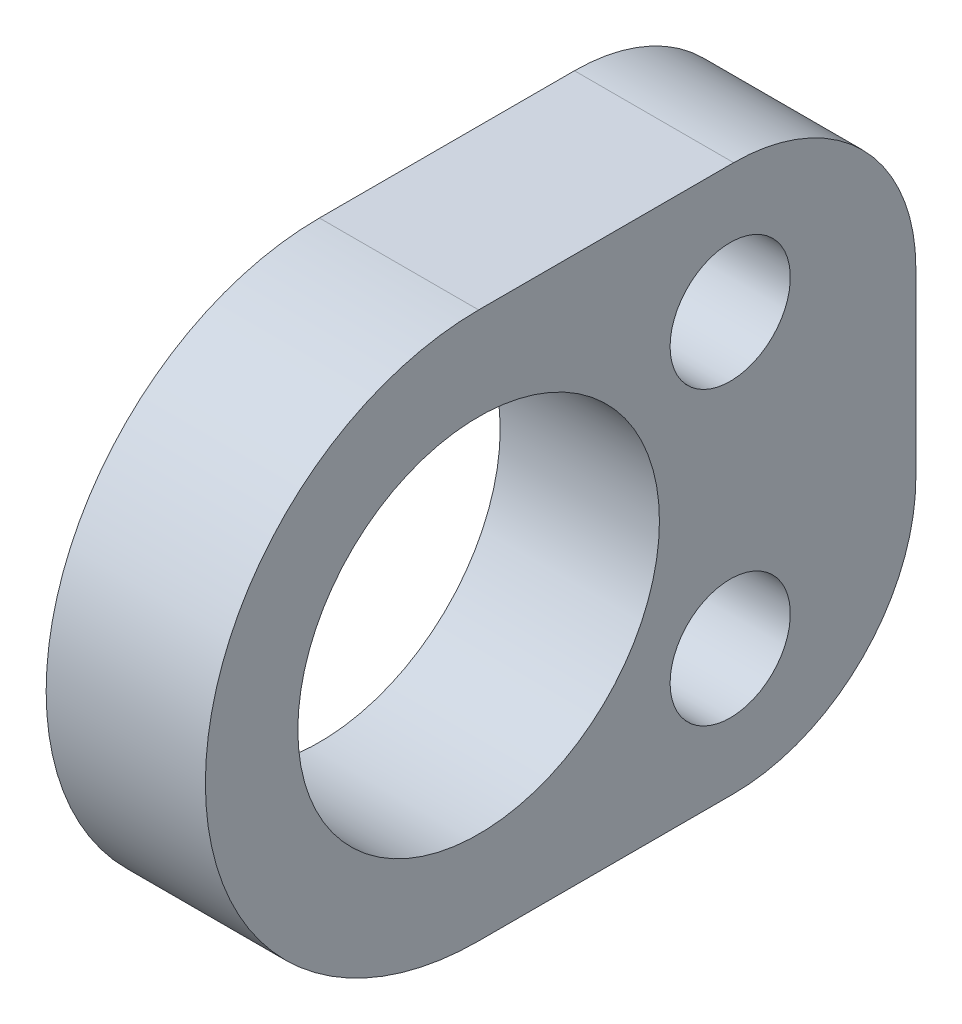
ISO-10303-21;
HEADER;
FILE_DESCRIPTION(('STEP AP214'),'2;1');
FILE_NAME('part.step','',(''),(''),'','','');
FILE_SCHEMA(('AUTOMOTIVE_DESIGN { 1 0 10303 214 1 1 1 1 }'));
ENDSEC;
DATA;
#1=APPLICATION_CONTEXT('core data for automotive mechanical design processes');
#2=APPLICATION_PROTOCOL_DEFINITION('international standard','automotive_design',2000,#1);
#3=PRODUCT_CONTEXT('',#1,'mechanical');
#4=PRODUCT('Part','Part','',(#3));
#5=PRODUCT_RELATED_PRODUCT_CATEGORY('part','',(#4));
#6=PRODUCT_DEFINITION_FORMATION('','',#4);
#7=PRODUCT_DEFINITION_CONTEXT('part definition',#1,'design');
#8=PRODUCT_DEFINITION('design','',#6,#7);
#9=PRODUCT_DEFINITION_SHAPE('','',#8);
#10=(LENGTH_UNIT() NAMED_UNIT(*) SI_UNIT(.MILLI.,.METRE.));
#11=(NAMED_UNIT(*) PLANE_ANGLE_UNIT() SI_UNIT($,.RADIAN.));
#12=(NAMED_UNIT(*) SI_UNIT($,.STERADIAN.) SOLID_ANGLE_UNIT());
#13=UNCERTAINTY_MEASURE_WITH_UNIT(LENGTH_MEASURE(1.E-05),#10,'distance_accuracy_value','');
#14=(GEOMETRIC_REPRESENTATION_CONTEXT(3) GLOBAL_UNCERTAINTY_ASSIGNED_CONTEXT((#13)) GLOBAL_UNIT_ASSIGNED_CONTEXT((#10,
#11,#12)) REPRESENTATION_CONTEXT('',''));
#15=CARTESIAN_POINT('',(0.,0.,0.));
#16=DIRECTION('',(0.,0.,1.));
#17=DIRECTION('',(1.,0.,0.));
#18=AXIS2_PLACEMENT_3D('',#15,#16,#17);
#19=CARTESIAN_POINT('',(4.37,0.,0.));
#20=DIRECTION('',(1.,0.,0.));
#21=DIRECTION('',(0.,0.,-1.));
#22=AXIS2_PLACEMENT_3D('',#19,#20,#21);
#23=PLANE('',#22);
#24=CARTESIAN_POINT('',(4.37,-4.,-6.9050995648144));
#25=DIRECTION('',(-1.,0.,0.));
#26=DIRECTION('',(0.,0.,1.));
#27=AXIS2_PLACEMENT_3D('',#24,#25,#26);
#28=CIRCLE('',#27,1.65);
#29=CARTESIAN_POINT('',(4.37,-4.,-5.2550995648144));
#30=VERTEX_POINT('',#29);
#31=EDGE_CURVE('E194',#30,#30,#28,.T.);
#32=ORIENTED_EDGE('',*,*,#31,.T.);
#33=EDGE_LOOP('',(#32));
#34=FACE_BOUND('',#33,.T.);
#35=CARTESIAN_POINT('',(4.37,4.,-6.9050995648144));
#36=DIRECTION('',(-1.,0.,0.));
#37=DIRECTION('',(0.,0.,1.));
#38=AXIS2_PLACEMENT_3D('',#35,#36,#37);
#39=CIRCLE('',#38,1.65);
#40=CARTESIAN_POINT('',(4.37,4.,-5.2550995648144));
#41=VERTEX_POINT('',#40);
#42=EDGE_CURVE('E202',#41,#41,#39,.T.);
#43=ORIENTED_EDGE('',*,*,#42,.T.);
#44=EDGE_LOOP('',(#43));
#45=FACE_BOUND('',#44,.T.);
#46=DIRECTION('',(0.,0.,1.));
#47=VECTOR('',#46,1.);
#48=CARTESIAN_POINT('',(4.37,-7.5,-12.));
#49=LINE('',#48,#47);
#50=CARTESIAN_POINT('',(4.37,-7.5,-7.));
#51=VERTEX_POINT('',#50);
#52=CARTESIAN_POINT('',(4.37,-7.5,0.));
#53=VERTEX_POINT('',#52);
#54=EDGE_CURVE('E117',#51,#53,#49,.T.);
#55=ORIENTED_EDGE('',*,*,#54,.F.);
#56=CARTESIAN_POINT('',(4.37,-2.5,-7.));
#57=DIRECTION('',(1.,0.,0.));
#58=DIRECTION('',(0.,0.,-1.));
#59=AXIS2_PLACEMENT_3D('',#56,#57,#58);
#60=CIRCLE('',#59,5.);
#61=CARTESIAN_POINT('',(4.37,-2.5,-12.));
#62=VERTEX_POINT('',#61);
#63=EDGE_CURVE('E71',#51,#62,#60,.T.);
#64=ORIENTED_EDGE('',*,*,#63,.T.);
#65=DIRECTION('',(0.,-1.,0.));
#66=VECTOR('',#65,1.);
#67=CARTESIAN_POINT('',(4.37,7.5,-12.));
#68=LINE('',#67,#66);
#69=CARTESIAN_POINT('',(4.37,2.5,-12.));
#70=VERTEX_POINT('',#69);
#71=EDGE_CURVE('E126',#70,#62,#68,.T.);
#72=ORIENTED_EDGE('',*,*,#71,.F.);
#73=CARTESIAN_POINT('',(4.37,2.5,-7.));
#74=DIRECTION('',(1.,0.,0.));
#75=DIRECTION('',(0.,0.,-1.));
#76=AXIS2_PLACEMENT_3D('',#73,#74,#75);
#77=CIRCLE('',#76,5.);
#78=CARTESIAN_POINT('',(4.37,7.5,-7.));
#79=VERTEX_POINT('',#78);
#80=EDGE_CURVE('E78',#70,#79,#77,.T.);
#81=ORIENTED_EDGE('',*,*,#80,.T.);
#82=DIRECTION('',(0.,0.,-1.));
#83=VECTOR('',#82,1.);
#84=CARTESIAN_POINT('',(4.37,7.5,0.));
#85=LINE('',#84,#83);
#86=CARTESIAN_POINT('',(4.37,7.5,0.));
#87=VERTEX_POINT('',#86);
#88=EDGE_CURVE('E130',#87,#79,#85,.T.);
#89=ORIENTED_EDGE('',*,*,#88,.F.);
#90=CARTESIAN_POINT('',(4.37,0.,0.));
#91=DIRECTION('',(1.,0.,0.));
#92=DIRECTION('',(0.,0.,-1.));
#93=AXIS2_PLACEMENT_3D('',#90,#91,#92);
#94=CIRCLE('',#93,7.5);
#95=EDGE_CURVE('E125',#87,#53,#94,.T.);
#96=ORIENTED_EDGE('',*,*,#95,.T.);
#97=EDGE_LOOP('',(#55,#64,#72,#81,#89,#96));
#98=FACE_BOUND('',#97,.T.);
#99=CARTESIAN_POINT('',(4.37,0.,0.));
#100=DIRECTION('',(1.,0.,0.));
#101=DIRECTION('',(0.,0.,-1.));
#102=AXIS2_PLACEMENT_3D('',#99,#100,#101);
#103=CIRCLE('',#102,4.9625);
#104=CARTESIAN_POINT('',(4.37,0.,-4.9625));
#105=VERTEX_POINT('',#104);
#106=EDGE_CURVE('E186',#105,#105,#103,.T.);
#107=ORIENTED_EDGE('',*,*,#106,.F.);
#108=EDGE_LOOP('',(#107));
#109=FACE_BOUND('',#108,.T.);
#110=ADVANCED_FACE('F62',(#34,#45,#98,#109),#23,.T.);
#111=CARTESIAN_POINT('',(0.,0.,0.));
#112=DIRECTION('',(1.,0.,0.));
#113=DIRECTION('',(0.,0.,-1.));
#114=AXIS2_PLACEMENT_3D('',#111,#112,#113);
#115=PLANE('',#114);
#116=CARTESIAN_POINT('',(0.,-4.,-6.9050995648144));
#117=DIRECTION('',(-1.,0.,0.));
#118=DIRECTION('',(0.,0.,1.));
#119=AXIS2_PLACEMENT_3D('',#116,#117,#118);
#120=CIRCLE('',#119,1.65);
#121=CARTESIAN_POINT('',(0.,-4.,-5.2550995648144));
#122=VERTEX_POINT('',#121);
#123=EDGE_CURVE('E206',#122,#122,#120,.T.);
#124=ORIENTED_EDGE('',*,*,#123,.F.);
#125=EDGE_LOOP('',(#124));
#126=FACE_BOUND('',#125,.T.);
#127=CARTESIAN_POINT('',(0.,4.,-6.9050995648144));
#128=DIRECTION('',(-1.,0.,0.));
#129=DIRECTION('',(0.,0.,1.));
#130=AXIS2_PLACEMENT_3D('',#127,#128,#129);
#131=CIRCLE('',#130,1.65);
#132=CARTESIAN_POINT('',(0.,4.,-5.2550995648144));
#133=VERTEX_POINT('',#132);
#134=EDGE_CURVE('E198',#133,#133,#131,.T.);
#135=ORIENTED_EDGE('',*,*,#134,.F.);
#136=EDGE_LOOP('',(#135));
#137=FACE_BOUND('',#136,.T.);
#138=DIRECTION('',(0.,-1.,0.));
#139=VECTOR('',#138,1.);
#140=CARTESIAN_POINT('',(0.,7.5,-12.));
#141=LINE('',#140,#139);
#142=CARTESIAN_POINT('',(0.,2.5,-12.));
#143=VERTEX_POINT('',#142);
#144=CARTESIAN_POINT('',(0.,-2.5,-12.));
#145=VERTEX_POINT('',#144);
#146=EDGE_CURVE('E176',#143,#145,#141,.T.);
#147=ORIENTED_EDGE('',*,*,#146,.T.);
#148=CARTESIAN_POINT('',(0.,-2.5,-7.));
#149=DIRECTION('',(1.,0.,0.));
#150=DIRECTION('',(0.,0.,-1.));
#151=AXIS2_PLACEMENT_3D('',#148,#149,#150);
#152=CIRCLE('',#151,5.);
#153=CARTESIAN_POINT('',(0.,-7.5,-7.));
#154=VERTEX_POINT('',#153);
#155=EDGE_CURVE('E154',#145,#154,#152,.F.);
#156=ORIENTED_EDGE('',*,*,#155,.T.);
#157=DIRECTION('',(0.,0.,1.));
#158=VECTOR('',#157,1.);
#159=CARTESIAN_POINT('',(0.,-7.5,-12.));
#160=LINE('',#159,#158);
#161=CARTESIAN_POINT('',(0.,-7.5,0.));
#162=VERTEX_POINT('',#161);
#163=EDGE_CURVE('E175',#154,#162,#160,.T.);
#164=ORIENTED_EDGE('',*,*,#163,.T.);
#165=CARTESIAN_POINT('',(0.,0.,0.));
#166=DIRECTION('',(1.,0.,0.));
#167=DIRECTION('',(0.,0.,-1.));
#168=AXIS2_PLACEMENT_3D('',#165,#166,#167);
#169=CIRCLE('',#168,7.5);
#170=CARTESIAN_POINT('',(0.,7.5,0.));
#171=VERTEX_POINT('',#170);
#172=EDGE_CURVE('E136',#171,#162,#169,.T.);
#173=ORIENTED_EDGE('',*,*,#172,.F.);
#174=DIRECTION('',(0.,0.,-1.));
#175=VECTOR('',#174,1.);
#176=CARTESIAN_POINT('',(0.,7.5,0.));
#177=LINE('',#176,#175);
#178=CARTESIAN_POINT('',(0.,7.5,-7.));
#179=VERTEX_POINT('',#178);
#180=EDGE_CURVE('E181',#171,#179,#177,.T.);
#181=ORIENTED_EDGE('',*,*,#180,.T.);
#182=CARTESIAN_POINT('',(0.,2.5,-7.));
#183=DIRECTION('',(1.,0.,0.));
#184=DIRECTION('',(0.,0.,-1.));
#185=AXIS2_PLACEMENT_3D('',#182,#183,#184);
#186=CIRCLE('',#185,5.);
#187=EDGE_CURVE('E151',#179,#143,#186,.F.);
#188=ORIENTED_EDGE('',*,*,#187,.T.);
#189=EDGE_LOOP('',(#147,#156,#164,#173,#181,#188));
#190=FACE_BOUND('',#189,.T.);
#191=CARTESIAN_POINT('',(0.,0.,0.));
#192=DIRECTION('',(1.,0.,0.));
#193=DIRECTION('',(0.,0.,-1.));
#194=AXIS2_PLACEMENT_3D('',#191,#192,#193);
#195=CIRCLE('',#194,4.9625);
#196=CARTESIAN_POINT('',(0.,0.,-4.9625));
#197=VERTEX_POINT('',#196);
#198=EDGE_CURVE('E190',#197,#197,#195,.T.);
#199=ORIENTED_EDGE('',*,*,#198,.T.);
#200=EDGE_LOOP('',(#199));
#201=FACE_BOUND('',#200,.T.);
#202=ADVANCED_FACE('F173',(#126,#137,#190,#201),#115,.F.);
#203=CARTESIAN_POINT('',(4.37,7.5,0.));
#204=DIRECTION('',(0.,1.,0.));
#205=DIRECTION('',(0.,0.,1.));
#206=AXIS2_PLACEMENT_3D('',#203,#204,#205);
#207=PLANE('',#206);
#208=ORIENTED_EDGE('',*,*,#88,.T.);
#209=DIRECTION('',(-1.,0.,0.));
#210=VECTOR('',#209,1.);
#211=CARTESIAN_POINT('',(4.37,7.5,-7.));
#212=LINE('',#211,#210);
#213=EDGE_CURVE('E12',#79,#179,#212,.T.);
#214=ORIENTED_EDGE('',*,*,#213,.T.);
#215=ORIENTED_EDGE('',*,*,#180,.F.);
#216=DIRECTION('',(-1.,0.,0.));
#217=VECTOR('',#216,1.);
#218=CARTESIAN_POINT('',(4.37,7.5,0.));
#219=LINE('',#218,#217);
#220=EDGE_CURVE('E138',#87,#171,#219,.T.);
#221=ORIENTED_EDGE('',*,*,#220,.F.);
#222=EDGE_LOOP('',(#208,#214,#215,#221));
#223=FACE_BOUND('',#222,.T.);
#224=ADVANCED_FACE('F225',(#223),#207,.T.);
#225=CARTESIAN_POINT('',(4.37,0.,0.));
#226=DIRECTION('',(-1.,0.,0.));
#227=DIRECTION('',(0.,0.,1.));
#228=AXIS2_PLACEMENT_3D('',#225,#226,#227);
#229=CYLINDRICAL_SURFACE('',#228,7.5);
#230=ORIENTED_EDGE('',*,*,#172,.T.);
#231=DIRECTION('',(-1.,0.,0.));
#232=VECTOR('',#231,1.);
#233=CARTESIAN_POINT('',(4.37,-7.5,0.));
#234=LINE('',#233,#232);
#235=EDGE_CURVE('E121',#53,#162,#234,.T.);
#236=ORIENTED_EDGE('',*,*,#235,.F.);
#237=ORIENTED_EDGE('',*,*,#95,.F.);
#238=ORIENTED_EDGE('',*,*,#220,.T.);
#239=EDGE_LOOP('',(#230,#236,#237,#238));
#240=FACE_BOUND('',#239,.T.);
#241=ADVANCED_FACE('F134',(#240),#229,.T.);
#242=CARTESIAN_POINT('',(4.37,-7.5,-12.));
#243=DIRECTION('',(0.,-1.,0.));
#244=DIRECTION('',(0.,0.,-1.));
#245=AXIS2_PLACEMENT_3D('',#242,#243,#244);
#246=PLANE('',#245);
#247=ORIENTED_EDGE('',*,*,#163,.F.);
#248=DIRECTION('',(-1.,0.,0.));
#249=VECTOR('',#248,1.);
#250=CARTESIAN_POINT('',(4.37,-7.5,-7.));
#251=LINE('',#250,#249);
#252=EDGE_CURVE('E86',#154,#51,#251,.F.);
#253=ORIENTED_EDGE('',*,*,#252,.T.);
#254=ORIENTED_EDGE('',*,*,#54,.T.);
#255=ORIENTED_EDGE('',*,*,#235,.T.);
#256=EDGE_LOOP('',(#247,#253,#254,#255));
#257=FACE_BOUND('',#256,.T.);
#258=ADVANCED_FACE('F119',(#257),#246,.T.);
#259=CARTESIAN_POINT('',(4.37,7.5,-12.));
#260=DIRECTION('',(0.,0.,-1.));
#261=DIRECTION('',(-1.,0.,0.));
#262=AXIS2_PLACEMENT_3D('',#259,#260,#261);
#263=PLANE('',#262);
#264=ORIENTED_EDGE('',*,*,#71,.T.);
#265=DIRECTION('',(-1.,0.,0.));
#266=VECTOR('',#265,1.);
#267=CARTESIAN_POINT('',(4.37,-2.5,-12.));
#268=LINE('',#267,#266);
#269=EDGE_CURVE('E147',#62,#145,#268,.T.);
#270=ORIENTED_EDGE('',*,*,#269,.T.);
#271=ORIENTED_EDGE('',*,*,#146,.F.);
#272=DIRECTION('',(-1.,0.,0.));
#273=VECTOR('',#272,1.);
#274=CARTESIAN_POINT('',(4.37,2.5,-12.));
#275=LINE('',#274,#273);
#276=EDGE_CURVE('E141',#143,#70,#275,.F.);
#277=ORIENTED_EDGE('',*,*,#276,.T.);
#278=EDGE_LOOP('',(#264,#270,#271,#277));
#279=FACE_BOUND('',#278,.T.);
#280=ADVANCED_FACE('F165',(#279),#263,.T.);
#281=CARTESIAN_POINT('',(4.37,0.,0.));
#282=DIRECTION('',(-1.,0.,0.));
#283=DIRECTION('',(0.,0.,1.));
#284=AXIS2_PLACEMENT_3D('',#281,#282,#283);
#285=CYLINDRICAL_SURFACE('',#284,4.9625);
#286=ORIENTED_EDGE('',*,*,#106,.T.);
#287=EDGE_LOOP('',(#286));
#288=FACE_BOUND('',#287,.T.);
#289=ORIENTED_EDGE('',*,*,#198,.F.);
#290=EDGE_LOOP('',(#289));
#291=FACE_BOUND('',#290,.T.);
#292=ADVANCED_FACE('F242',(#288,#291),#285,.F.);
#293=CARTESIAN_POINT('',(4.37,-2.5,-7.));
#294=DIRECTION('',(-1.,0.,0.));
#295=DIRECTION('',(0.,0.,1.));
#296=AXIS2_PLACEMENT_3D('',#293,#294,#295);
#297=CYLINDRICAL_SURFACE('',#296,5.);
#298=ORIENTED_EDGE('',*,*,#63,.F.);
#299=ORIENTED_EDGE('',*,*,#252,.F.);
#300=ORIENTED_EDGE('',*,*,#155,.F.);
#301=ORIENTED_EDGE('',*,*,#269,.F.);
#302=EDGE_LOOP('',(#298,#299,#300,#301));
#303=FACE_BOUND('',#302,.T.);
#304=ADVANCED_FACE('F171',(#303),#297,.T.);
#305=CARTESIAN_POINT('',(4.37,2.5,-7.));
#306=DIRECTION('',(-1.,0.,0.));
#307=DIRECTION('',(0.,0.,1.));
#308=AXIS2_PLACEMENT_3D('',#305,#306,#307);
#309=CYLINDRICAL_SURFACE('',#308,5.);
#310=ORIENTED_EDGE('',*,*,#80,.F.);
#311=ORIENTED_EDGE('',*,*,#276,.F.);
#312=ORIENTED_EDGE('',*,*,#187,.F.);
#313=ORIENTED_EDGE('',*,*,#213,.F.);
#314=EDGE_LOOP('',(#310,#311,#312,#313));
#315=FACE_BOUND('',#314,.T.);
#316=ADVANCED_FACE('F64',(#315),#309,.T.);
#317=CARTESIAN_POINT('',(4.37,4.,-6.9050995648144));
#318=DIRECTION('',(-1.,0.,0.));
#319=DIRECTION('',(0.,0.,1.));
#320=AXIS2_PLACEMENT_3D('',#317,#318,#319);
#321=CYLINDRICAL_SURFACE('',#320,1.65);
#322=ORIENTED_EDGE('',*,*,#42,.F.);
#323=EDGE_LOOP('',(#322));
#324=FACE_BOUND('',#323,.T.);
#325=ORIENTED_EDGE('',*,*,#134,.T.);
#326=EDGE_LOOP('',(#325));
#327=FACE_BOUND('',#326,.T.);
#328=ADVANCED_FACE('F219',(#324,#327),#321,.F.);
#329=CARTESIAN_POINT('',(4.37,-4.,-6.9050995648144));
#330=DIRECTION('',(-1.,0.,0.));
#331=DIRECTION('',(0.,0.,1.));
#332=AXIS2_PLACEMENT_3D('',#329,#330,#331);
#333=CYLINDRICAL_SURFACE('',#332,1.65);
#334=ORIENTED_EDGE('',*,*,#31,.F.);
#335=EDGE_LOOP('',(#334));
#336=FACE_BOUND('',#335,.T.);
#337=ORIENTED_EDGE('',*,*,#123,.T.);
#338=EDGE_LOOP('',(#337));
#339=FACE_BOUND('',#338,.T.);
#340=ADVANCED_FACE('F216',(#336,#339),#333,.F.);
#341=CLOSED_SHELL('',(#110,#202,#224,#241,#258,#280,#292,#304,#316,#328,#340));
#342=MANIFOLD_SOLID_BREP('B2',#341);
#343=ADVANCED_BREP_SHAPE_REPRESENTATION('',(#18,#342),#14);
#344=SHAPE_DEFINITION_REPRESENTATION(#9,#343);
ENDSEC;
END-ISO-10303-21;
